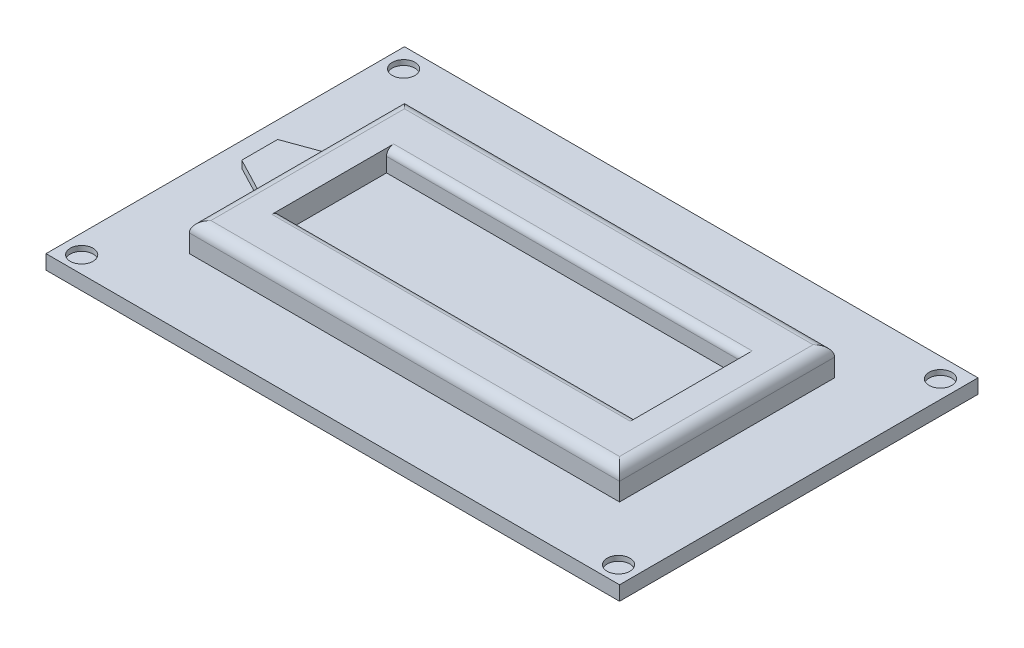
ISO-10303-21;
HEADER;
FILE_DESCRIPTION(('STEP AP214'),'2;1');
FILE_NAME('part.step','',(''),(''),'','','');
FILE_SCHEMA(('AUTOMOTIVE_DESIGN { 1 0 10303 214 1 1 1 1 }'));
ENDSEC;
DATA;
#1=APPLICATION_CONTEXT('core data for automotive mechanical design processes');
#2=APPLICATION_PROTOCOL_DEFINITION('international standard','automotive_design',2000,#1);
#3=PRODUCT_CONTEXT('',#1,'mechanical');
#4=PRODUCT('Part','Part','',(#3));
#5=PRODUCT_RELATED_PRODUCT_CATEGORY('part','',(#4));
#6=PRODUCT_DEFINITION_FORMATION('','',#4);
#7=PRODUCT_DEFINITION_CONTEXT('part definition',#1,'design');
#8=PRODUCT_DEFINITION('design','',#6,#7);
#9=PRODUCT_DEFINITION_SHAPE('','',#8);
#10=(LENGTH_UNIT() NAMED_UNIT(*) SI_UNIT(.MILLI.,.METRE.));
#11=(NAMED_UNIT(*) PLANE_ANGLE_UNIT() SI_UNIT($,.RADIAN.));
#12=(NAMED_UNIT(*) SI_UNIT($,.STERADIAN.) SOLID_ANGLE_UNIT());
#13=UNCERTAINTY_MEASURE_WITH_UNIT(LENGTH_MEASURE(1.E-05),#10,'distance_accuracy_value','');
#14=(GEOMETRIC_REPRESENTATION_CONTEXT(3) GLOBAL_UNCERTAINTY_ASSIGNED_CONTEXT((#13)) GLOBAL_UNIT_ASSIGNED_CONTEXT((#10,
#11,#12)) REPRESENTATION_CONTEXT('',''));
#15=CARTESIAN_POINT('',(0.,0.,0.));
#16=DIRECTION('',(0.,0.,1.));
#17=DIRECTION('',(1.,0.,0.));
#18=AXIS2_PLACEMENT_3D('',#15,#16,#17);
#19=CARTESIAN_POINT('',(-47.7639751552795,6.,-10.9627329192547));
#20=DIRECTION('',(1.,0.,0.));
#21=DIRECTION('',(0.,0.,-1.));
#22=AXIS2_PLACEMENT_3D('',#19,#20,#21);
#23=PLANE('',#22);
#24=DIRECTION('',(0.,-1.,0.));
#25=VECTOR('',#24,1.);
#26=CARTESIAN_POINT('',(-47.7639751552795,6.,19.0372670807453));
#27=LINE('',#26,#25);
#28=CARTESIAN_POINT('',(-47.7639751552795,4.5,19.0372670807453));
#29=VERTEX_POINT('',#28);
#30=CARTESIAN_POINT('',(-47.7639751552795,2.,19.0372670807453));
#31=VERTEX_POINT('',#30);
#32=EDGE_CURVE('E271',#29,#31,#27,.T.);
#33=ORIENTED_EDGE('',*,*,#32,.F.);
#34=DIRECTION('',(0.,0.,1.));
#35=VECTOR('',#34,1.);
#36=CARTESIAN_POINT('',(-47.7639751552795,4.5,-10.9627329192547));
#37=LINE('',#36,#35);
#38=CARTESIAN_POINT('',(-47.7639751552795,4.5,-10.9627329192547));
#39=VERTEX_POINT('',#38);
#40=EDGE_CURVE('E359',#29,#39,#37,.F.);
#41=ORIENTED_EDGE('',*,*,#40,.T.);
#42=DIRECTION('',(0.,-1.,0.));
#43=VECTOR('',#42,1.);
#44=CARTESIAN_POINT('',(-47.7639751552795,6.,-10.9627329192547));
#45=LINE('',#44,#43);
#46=CARTESIAN_POINT('',(-47.7639751552795,2.,-10.9627329192547));
#47=VERTEX_POINT('',#46);
#48=EDGE_CURVE('E262',#39,#47,#45,.T.);
#49=ORIENTED_EDGE('',*,*,#48,.T.);
#50=DIRECTION('',(0.,0.,1.));
#51=VECTOR('',#50,1.);
#52=CARTESIAN_POINT('',(-47.7639751552795,2.,-10.9627329192547));
#53=LINE('',#52,#51);
#54=EDGE_CURVE('E246',#47,#31,#53,.T.);
#55=ORIENTED_EDGE('',*,*,#54,.T.);
#56=EDGE_LOOP('',(#33,#41,#49,#55));
#57=FACE_BOUND('',#56,.T.);
#58=DIRECTION('',(0.,0.,-1.));
#59=VECTOR('',#58,1.);
#60=CARTESIAN_POINT('',(-47.7639751552795,4.,-0.962732919254658));
#61=LINE('',#60,#59);
#62=CARTESIAN_POINT('',(-47.7639751552795,4.,9.03726708074534));
#63=VERTEX_POINT('',#62);
#64=CARTESIAN_POINT('',(-47.7639751552795,4.,-0.962732919254658));
#65=VERTEX_POINT('',#64);
#66=EDGE_CURVE('E196',#63,#65,#61,.T.);
#67=ORIENTED_EDGE('',*,*,#66,.F.);
#68=DIRECTION('',(0.,-1.,0.));
#69=VECTOR('',#68,1.);
#70=CARTESIAN_POINT('',(-47.7639751552795,4.,9.03726708074534));
#71=LINE('',#70,#69);
#72=CARTESIAN_POINT('',(-47.7639751552795,3.,9.03726708074534));
#73=VERTEX_POINT('',#72);
#74=EDGE_CURVE('E213',#63,#73,#71,.T.);
#75=ORIENTED_EDGE('',*,*,#74,.T.);
#76=DIRECTION('',(0.,0.,-1.));
#77=VECTOR('',#76,1.);
#78=CARTESIAN_POINT('',(-47.7639751552795,3.,-0.962732919254658));
#79=LINE('',#78,#77);
#80=CARTESIAN_POINT('',(-47.7639751552795,3.,-0.962732919254658));
#81=VERTEX_POINT('',#80);
#82=EDGE_CURVE('E201',#73,#81,#79,.T.);
#83=ORIENTED_EDGE('',*,*,#82,.T.);
#84=DIRECTION('',(0.,-1.,0.));
#85=VECTOR('',#84,1.);
#86=CARTESIAN_POINT('',(-47.7639751552795,4.,-0.962732919254658));
#87=LINE('',#86,#85);
#88=EDGE_CURVE('E399',#65,#81,#87,.T.);
#89=ORIENTED_EDGE('',*,*,#88,.F.);
#90=EDGE_LOOP('',(#67,#75,#83,#89));
#91=FACE_BOUND('',#90,.T.);
#92=ADVANCED_FACE('F40',(#57,#91),#23,.F.);
#93=CARTESIAN_POINT('',(0.,2.,0.));
#94=DIRECTION('',(0.,1.,0.));
#95=DIRECTION('',(0.,0.,1.));
#96=AXIS2_PLACEMENT_3D('',#93,#94,#95);
#97=PLANE('',#96);
#98=CARTESIAN_POINT('',(-55.1397341812617,2.,-18.2194783114628));
#99=DIRECTION('',(0.,1.,0.));
#100=DIRECTION('',(0.,0.,1.));
#101=AXIS2_PLACEMENT_3D('',#98,#99,#100);
#102=CIRCLE('',#101,1.5875);
#103=CARTESIAN_POINT('',(-55.1397341812617,2.,-16.6319783114628));
#104=VERTEX_POINT('',#103);
#105=EDGE_CURVE('E762',#104,#104,#102,.T.);
#106=ORIENTED_EDGE('',*,*,#105,.F.);
#107=EDGE_LOOP('',(#106));
#108=FACE_BOUND('',#107,.T.);
#109=CARTESIAN_POINT('',(19.7415608117652,2.,-18.2194783114628));
#110=DIRECTION('',(0.,1.,0.));
#111=DIRECTION('',(0.,0.,1.));
#112=AXIS2_PLACEMENT_3D('',#109,#110,#111);
#113=CIRCLE('',#112,1.5875);
#114=CARTESIAN_POINT('',(19.7415608117652,2.,-16.6319783114628));
#115=VERTEX_POINT('',#114);
#116=EDGE_CURVE('E772',#115,#115,#113,.T.);
#117=ORIENTED_EDGE('',*,*,#116,.F.);
#118=EDGE_LOOP('',(#117));
#119=FACE_BOUND('',#118,.T.);
#120=CARTESIAN_POINT('',(-55.1397341812617,2.,26.6833432961408));
#121=DIRECTION('',(0.,1.,0.));
#122=DIRECTION('',(0.,0.,1.));
#123=AXIS2_PLACEMENT_3D('',#120,#121,#122);
#124=CIRCLE('',#123,1.5875);
#125=CARTESIAN_POINT('',(-55.1397341812617,2.,28.2708432961408));
#126=VERTEX_POINT('',#125);
#127=EDGE_CURVE('E780',#126,#126,#124,.T.);
#128=ORIENTED_EDGE('',*,*,#127,.F.);
#129=EDGE_LOOP('',(#128));
#130=FACE_BOUND('',#129,.T.);
#131=CARTESIAN_POINT('',(19.7415608117652,2.,26.6833432961408));
#132=DIRECTION('',(0.,1.,0.));
#133=DIRECTION('',(0.,0.,1.));
#134=AXIS2_PLACEMENT_3D('',#131,#132,#133);
#135=CIRCLE('',#134,1.5875);
#136=CARTESIAN_POINT('',(19.7415608117652,2.,28.2708432961408));
#137=VERTEX_POINT('',#136);
#138=EDGE_CURVE('E371',#137,#137,#135,.T.);
#139=ORIENTED_EDGE('',*,*,#138,.F.);
#140=EDGE_LOOP('',(#139));
#141=FACE_BOUND('',#140,.T.);
#142=DIRECTION('',(0.,0.,1.));
#143=VECTOR('',#142,1.);
#144=CARTESIAN_POINT('',(-57.7639751552795,2.,-20.9627329192547));
#145=LINE('',#144,#143);
#146=CARTESIAN_POINT('',(-57.7639751552795,2.,-20.9627329192547));
#147=VERTEX_POINT('',#146);
#148=CARTESIAN_POINT('',(-57.7639751552795,2.,29.0372670807453));
#149=VERTEX_POINT('',#148);
#150=EDGE_CURVE('E275',#147,#149,#145,.T.);
#151=ORIENTED_EDGE('',*,*,#150,.T.);
#152=DIRECTION('',(1.,0.,0.));
#153=VECTOR('',#152,1.);
#154=CARTESIAN_POINT('',(-57.7639751552795,2.,29.0372670807453));
#155=LINE('',#154,#153);
#156=CARTESIAN_POINT('',(22.2360248447205,2.,29.0372670807453));
#157=VERTEX_POINT('',#156);
#158=EDGE_CURVE('E279',#149,#157,#155,.T.);
#159=ORIENTED_EDGE('',*,*,#158,.T.);
#160=DIRECTION('',(0.,0.,-1.));
#161=VECTOR('',#160,1.);
#162=CARTESIAN_POINT('',(22.2360248447205,2.,-20.9627329192547));
#163=LINE('',#162,#161);
#164=CARTESIAN_POINT('',(22.2360248447205,2.,-20.9627329192547));
#165=VERTEX_POINT('',#164);
#166=EDGE_CURVE('E283',#157,#165,#163,.T.);
#167=ORIENTED_EDGE('',*,*,#166,.T.);
#168=DIRECTION('',(-1.,0.,0.));
#169=VECTOR('',#168,1.);
#170=CARTESIAN_POINT('',(-57.7639751552795,2.,-20.9627329192547));
#171=LINE('',#170,#169);
#172=EDGE_CURVE('E286',#165,#147,#171,.T.);
#173=ORIENTED_EDGE('',*,*,#172,.T.);
#174=EDGE_LOOP('',(#151,#159,#167,#173));
#175=FACE_BOUND('',#174,.T.);
#176=DIRECTION('',(1.,0.,0.));
#177=VECTOR('',#176,1.);
#178=CARTESIAN_POINT('',(-47.7639751552795,2.,19.0372670807453));
#179=LINE('',#178,#177);
#180=CARTESIAN_POINT('',(12.2360248447205,2.,19.0372670807453));
#181=VERTEX_POINT('',#180);
#182=EDGE_CURVE('E250',#31,#181,#179,.T.);
#183=ORIENTED_EDGE('',*,*,#182,.F.);
#184=ORIENTED_EDGE('',*,*,#54,.F.);
#185=DIRECTION('',(-1.,0.,0.));
#186=VECTOR('',#185,1.);
#187=CARTESIAN_POINT('',(-47.7639751552795,2.,-10.9627329192547));
#188=LINE('',#187,#186);
#189=CARTESIAN_POINT('',(12.2360248447205,2.,-10.9627329192547));
#190=VERTEX_POINT('',#189);
#191=EDGE_CURVE('E258',#190,#47,#188,.T.);
#192=ORIENTED_EDGE('',*,*,#191,.F.);
#193=DIRECTION('',(0.,0.,-1.));
#194=VECTOR('',#193,1.);
#195=CARTESIAN_POINT('',(12.2360248447205,2.,-10.9627329192547));
#196=LINE('',#195,#194);
#197=EDGE_CURVE('E254',#181,#190,#196,.T.);
#198=ORIENTED_EDGE('',*,*,#197,.F.);
#199=EDGE_LOOP('',(#183,#184,#192,#198));
#200=FACE_BOUND('',#199,.T.);
#201=ADVANCED_FACE('F424',(#108,#119,#130,#141,#175,#200),#97,.T.);
#202=CARTESIAN_POINT('',(-57.7639751552795,2.,-20.9627329192547));
#203=DIRECTION('',(1.,0.,0.));
#204=DIRECTION('',(0.,0.,-1.));
#205=AXIS2_PLACEMENT_3D('',#202,#203,#204);
#206=PLANE('',#205);
#207=DIRECTION('',(0.,0.,1.));
#208=VECTOR('',#207,1.);
#209=CARTESIAN_POINT('',(-57.7639751552795,0.,-20.9627329192547));
#210=LINE('',#209,#208);
#211=CARTESIAN_POINT('',(-57.7639751552795,0.,-20.9627329192547));
#212=VERTEX_POINT('',#211);
#213=CARTESIAN_POINT('',(-57.7639751552795,0.,29.0372670807453));
#214=VERTEX_POINT('',#213);
#215=EDGE_CURVE('E274',#212,#214,#210,.T.);
#216=ORIENTED_EDGE('',*,*,#215,.T.);
#217=DIRECTION('',(0.,-1.,0.));
#218=VECTOR('',#217,1.);
#219=CARTESIAN_POINT('',(-57.7639751552795,2.,29.0372670807453));
#220=LINE('',#219,#218);
#221=EDGE_CURVE('E312',#149,#214,#220,.T.);
#222=ORIENTED_EDGE('',*,*,#221,.F.);
#223=ORIENTED_EDGE('',*,*,#150,.F.);
#224=DIRECTION('',(0.,-1.,0.));
#225=VECTOR('',#224,1.);
#226=CARTESIAN_POINT('',(-57.7639751552795,2.,-20.9627329192547));
#227=LINE('',#226,#225);
#228=EDGE_CURVE('E289',#147,#212,#227,.T.);
#229=ORIENTED_EDGE('',*,*,#228,.T.);
#230=EDGE_LOOP('',(#216,#222,#223,#229));
#231=FACE_BOUND('',#230,.T.);
#232=ADVANCED_FACE('F432',(#231),#206,.F.);
#233=CARTESIAN_POINT('',(-57.7639751552795,2.,29.0372670807453));
#234=DIRECTION('',(0.,0.,-1.));
#235=DIRECTION('',(-1.,0.,0.));
#236=AXIS2_PLACEMENT_3D('',#233,#234,#235);
#237=PLANE('',#236);
#238=DIRECTION('',(1.,0.,0.));
#239=VECTOR('',#238,1.);
#240=CARTESIAN_POINT('',(-57.7639751552795,0.,29.0372670807453));
#241=LINE('',#240,#239);
#242=CARTESIAN_POINT('',(22.2360248447205,0.,29.0372670807453));
#243=VERTEX_POINT('',#242);
#244=EDGE_CURVE('E293',#214,#243,#241,.T.);
#245=ORIENTED_EDGE('',*,*,#244,.T.);
#246=DIRECTION('',(0.,-1.,0.));
#247=VECTOR('',#246,1.);
#248=CARTESIAN_POINT('',(22.2360248447205,2.,29.0372670807453));
#249=LINE('',#248,#247);
#250=EDGE_CURVE('E308',#157,#243,#249,.T.);
#251=ORIENTED_EDGE('',*,*,#250,.F.);
#252=ORIENTED_EDGE('',*,*,#158,.F.);
#253=ORIENTED_EDGE('',*,*,#221,.T.);
#254=EDGE_LOOP('',(#245,#251,#252,#253));
#255=FACE_BOUND('',#254,.T.);
#256=ADVANCED_FACE('F452',(#255),#237,.F.);
#257=CARTESIAN_POINT('',(22.2360248447205,2.,-20.9627329192547));
#258=DIRECTION('',(-1.,0.,0.));
#259=DIRECTION('',(0.,0.,1.));
#260=AXIS2_PLACEMENT_3D('',#257,#258,#259);
#261=PLANE('',#260);
#262=DIRECTION('',(0.,0.,-1.));
#263=VECTOR('',#262,1.);
#264=CARTESIAN_POINT('',(22.2360248447205,0.,-20.9627329192547));
#265=LINE('',#264,#263);
#266=CARTESIAN_POINT('',(22.2360248447205,0.,-20.9627329192547));
#267=VERTEX_POINT('',#266);
#268=EDGE_CURVE('E296',#243,#267,#265,.T.);
#269=ORIENTED_EDGE('',*,*,#268,.T.);
#270=DIRECTION('',(0.,-1.,0.));
#271=VECTOR('',#270,1.);
#272=CARTESIAN_POINT('',(22.2360248447205,2.,-20.9627329192547));
#273=LINE('',#272,#271);
#274=EDGE_CURVE('E304',#165,#267,#273,.T.);
#275=ORIENTED_EDGE('',*,*,#274,.F.);
#276=ORIENTED_EDGE('',*,*,#166,.F.);
#277=ORIENTED_EDGE('',*,*,#250,.T.);
#278=EDGE_LOOP('',(#269,#275,#276,#277));
#279=FACE_BOUND('',#278,.T.);
#280=ADVANCED_FACE('F448',(#279),#261,.F.);
#281=CARTESIAN_POINT('',(-57.7639751552795,2.,-20.9627329192547));
#282=DIRECTION('',(0.,0.,1.));
#283=DIRECTION('',(1.,0.,0.));
#284=AXIS2_PLACEMENT_3D('',#281,#282,#283);
#285=PLANE('',#284);
#286=DIRECTION('',(-1.,0.,0.));
#287=VECTOR('',#286,1.);
#288=CARTESIAN_POINT('',(-57.7639751552795,0.,-20.9627329192547));
#289=LINE('',#288,#287);
#290=EDGE_CURVE('E280',#267,#212,#289,.T.);
#291=ORIENTED_EDGE('',*,*,#290,.T.);
#292=ORIENTED_EDGE('',*,*,#228,.F.);
#293=ORIENTED_EDGE('',*,*,#172,.F.);
#294=ORIENTED_EDGE('',*,*,#274,.T.);
#295=EDGE_LOOP('',(#291,#292,#293,#294));
#296=FACE_BOUND('',#295,.T.);
#297=ADVANCED_FACE('F444',(#296),#285,.F.);
#298=CARTESIAN_POINT('',(0.,0.,0.));
#299=DIRECTION('',(0.,1.,0.));
#300=DIRECTION('',(0.,0.,1.));
#301=AXIS2_PLACEMENT_3D('',#298,#299,#300);
#302=PLANE('',#301);
#303=ORIENTED_EDGE('',*,*,#215,.F.);
#304=ORIENTED_EDGE('',*,*,#290,.F.);
#305=ORIENTED_EDGE('',*,*,#268,.F.);
#306=ORIENTED_EDGE('',*,*,#244,.F.);
#307=EDGE_LOOP('',(#303,#304,#305,#306));
#308=FACE_BOUND('',#307,.T.);
#309=ADVANCED_FACE('F440',(#308),#302,.F.);
#310=CARTESIAN_POINT('',(0.,6.,0.));
#311=DIRECTION('',(0.,1.,0.));
#312=DIRECTION('',(0.,0.,1.));
#313=AXIS2_PLACEMENT_3D('',#310,#311,#312);
#314=PLANE('',#313);
#315=DIRECTION('',(-1.,0.,0.));
#316=VECTOR('',#315,1.);
#317=CARTESIAN_POINT('',(-47.7639751552795,6.,-9.46273291925466));
#318=LINE('',#317,#316);
#319=CARTESIAN_POINT('',(10.7360248447205,6.,-9.46273291925466));
#320=VERTEX_POINT('',#319);
#321=CARTESIAN_POINT('',(-46.2639751552795,6.,-9.46273291925466));
#322=VERTEX_POINT('',#321);
#323=EDGE_CURVE('E352',#320,#322,#318,.T.);
#324=ORIENTED_EDGE('',*,*,#323,.T.);
#325=DIRECTION('',(0.,0.,1.));
#326=VECTOR('',#325,1.);
#327=CARTESIAN_POINT('',(-46.2639751552795,6.,19.0372670807453));
#328=LINE('',#327,#326);
#329=CARTESIAN_POINT('',(-46.2639751552795,6.,17.5372670807453));
#330=VERTEX_POINT('',#329);
#331=EDGE_CURVE('E355',#322,#330,#328,.T.);
#332=ORIENTED_EDGE('',*,*,#331,.T.);
#333=DIRECTION('',(1.,0.,0.));
#334=VECTOR('',#333,1.);
#335=CARTESIAN_POINT('',(12.2360248447205,6.,17.5372670807453));
#336=LINE('',#335,#334);
#337=CARTESIAN_POINT('',(10.7360248447205,6.,17.5372670807453));
#338=VERTEX_POINT('',#337);
#339=EDGE_CURVE('E346',#330,#338,#336,.T.);
#340=ORIENTED_EDGE('',*,*,#339,.T.);
#341=DIRECTION('',(0.,0.,-1.));
#342=VECTOR('',#341,1.);
#343=CARTESIAN_POINT('',(10.7360248447205,6.,-10.9627329192547));
#344=LINE('',#343,#342);
#345=EDGE_CURVE('E349',#338,#320,#344,.T.);
#346=ORIENTED_EDGE('',*,*,#345,.T.);
#347=EDGE_LOOP('',(#324,#332,#340,#346));
#348=FACE_BOUND('',#347,.T.);
#349=DIRECTION('',(0.,0.,-1.));
#350=VECTOR('',#349,1.);
#351=CARTESIAN_POINT('',(7.23602484472052,6.,-3.46273291925466));
#352=LINE('',#351,#350);
#353=CARTESIAN_POINT('',(7.23602484472052,6.,12.5372670807453));
#354=VERTEX_POINT('',#353);
#355=CARTESIAN_POINT('',(7.23602484472052,6.,-4.46273291925466));
#356=VERTEX_POINT('',#355);
#357=EDGE_CURVE('E231',#354,#356,#352,.T.);
#358=ORIENTED_EDGE('',*,*,#357,.F.);
#359=DIRECTION('',(1.,0.,0.));
#360=VECTOR('',#359,1.);
#361=CARTESIAN_POINT('',(0.,6.,12.5372670807453));
#362=LINE('',#361,#360);
#363=CARTESIAN_POINT('',(-42.7639751552795,6.,12.5372670807453));
#364=VERTEX_POINT('',#363);
#365=EDGE_CURVE('E324',#354,#364,#362,.F.);
#366=ORIENTED_EDGE('',*,*,#365,.T.);
#367=DIRECTION('',(0.,0.,1.));
#368=VECTOR('',#367,1.);
#369=CARTESIAN_POINT('',(-42.7639751552795,6.,-3.46273291925466));
#370=LINE('',#369,#368);
#371=CARTESIAN_POINT('',(-42.7639751552795,6.,-4.46273291925466));
#372=VERTEX_POINT('',#371);
#373=EDGE_CURVE('E228',#372,#364,#370,.T.);
#374=ORIENTED_EDGE('',*,*,#373,.F.);
#375=DIRECTION('',(-1.,0.,0.));
#376=VECTOR('',#375,1.);
#377=CARTESIAN_POINT('',(0.,6.,-4.46273291925466));
#378=LINE('',#377,#376);
#379=EDGE_CURVE('E320',#372,#356,#378,.F.);
#380=ORIENTED_EDGE('',*,*,#379,.T.);
#381=EDGE_LOOP('',(#358,#366,#374,#380));
#382=FACE_BOUND('',#381,.T.);
#383=ADVANCED_FACE('F443',(#348,#382),#314,.T.);
#384=CARTESIAN_POINT('',(-47.7639751552795,6.,19.0372670807453));
#385=DIRECTION('',(0.,0.,-1.));
#386=DIRECTION('',(-1.,0.,0.));
#387=AXIS2_PLACEMENT_3D('',#384,#385,#386);
#388=PLANE('',#387);
#389=DIRECTION('',(0.,-1.,0.));
#390=VECTOR('',#389,1.);
#391=CARTESIAN_POINT('',(12.2360248447205,6.,19.0372670807453));
#392=LINE('',#391,#390);
#393=CARTESIAN_POINT('',(12.2360248447205,4.5,19.0372670807453));
#394=VERTEX_POINT('',#393);
#395=EDGE_CURVE('E268',#394,#181,#392,.T.);
#396=ORIENTED_EDGE('',*,*,#395,.F.);
#397=DIRECTION('',(1.,0.,0.));
#398=VECTOR('',#397,1.);
#399=CARTESIAN_POINT('',(-47.7639751552795,4.5,19.0372670807453));
#400=LINE('',#399,#398);
#401=EDGE_CURVE('E11',#394,#29,#400,.F.);
#402=ORIENTED_EDGE('',*,*,#401,.T.);
#403=ORIENTED_EDGE('',*,*,#32,.T.);
#404=ORIENTED_EDGE('',*,*,#182,.T.);
#405=EDGE_LOOP('',(#396,#402,#403,#404));
#406=FACE_BOUND('',#405,.T.);
#407=ADVANCED_FACE('F437',(#406),#388,.F.);
#408=CARTESIAN_POINT('',(12.2360248447205,6.,-10.9627329192547));
#409=DIRECTION('',(-1.,0.,0.));
#410=DIRECTION('',(0.,0.,1.));
#411=AXIS2_PLACEMENT_3D('',#408,#409,#410);
#412=PLANE('',#411);
#413=DIRECTION('',(0.,-1.,0.));
#414=VECTOR('',#413,1.);
#415=CARTESIAN_POINT('',(12.2360248447205,6.,-10.9627329192547));
#416=LINE('',#415,#414);
#417=CARTESIAN_POINT('',(12.2360248447205,4.5,-10.9627329192547));
#418=VERTEX_POINT('',#417);
#419=EDGE_CURVE('E265',#418,#190,#416,.T.);
#420=ORIENTED_EDGE('',*,*,#419,.F.);
#421=DIRECTION('',(0.,0.,-1.));
#422=VECTOR('',#421,1.);
#423=CARTESIAN_POINT('',(12.2360248447205,4.5,19.0372670807453));
#424=LINE('',#423,#422);
#425=EDGE_CURVE('E50',#418,#394,#424,.F.);
#426=ORIENTED_EDGE('',*,*,#425,.T.);
#427=ORIENTED_EDGE('',*,*,#395,.T.);
#428=ORIENTED_EDGE('',*,*,#197,.T.);
#429=EDGE_LOOP('',(#420,#426,#427,#428));
#430=FACE_BOUND('',#429,.T.);
#431=ADVANCED_FACE('F528',(#430),#412,.F.);
#432=CARTESIAN_POINT('',(-47.7639751552795,6.,-10.9627329192547));
#433=DIRECTION('',(0.,0.,1.));
#434=DIRECTION('',(1.,0.,0.));
#435=AXIS2_PLACEMENT_3D('',#432,#433,#434);
#436=PLANE('',#435);
#437=ORIENTED_EDGE('',*,*,#48,.F.);
#438=DIRECTION('',(-1.,0.,0.));
#439=VECTOR('',#438,1.);
#440=CARTESIAN_POINT('',(12.2360248447205,4.5,-10.9627329192547));
#441=LINE('',#440,#439);
#442=EDGE_CURVE('E65',#39,#418,#441,.F.);
#443=ORIENTED_EDGE('',*,*,#442,.T.);
#444=ORIENTED_EDGE('',*,*,#419,.T.);
#445=ORIENTED_EDGE('',*,*,#191,.T.);
#446=EDGE_LOOP('',(#437,#443,#444,#445));
#447=FACE_BOUND('',#446,.T.);
#448=ADVANCED_FACE('F526',(#447),#436,.F.);
#449=CARTESIAN_POINT('',(-42.7639751552795,6.,-3.46273291925466));
#450=DIRECTION('',(1.,0.,0.));
#451=DIRECTION('',(0.,0.,-1.));
#452=AXIS2_PLACEMENT_3D('',#449,#450,#451);
#453=PLANE('',#452);
#454=DIRECTION('',(0.,0.,1.));
#455=VECTOR('',#454,1.);
#456=CARTESIAN_POINT('',(-42.7639751552795,3.,-3.46273291925466));
#457=LINE('',#456,#455);
#458=CARTESIAN_POINT('',(-42.7639751552795,3.,-3.46273291925466));
#459=VERTEX_POINT('',#458);
#460=CARTESIAN_POINT('',(-42.7639751552795,3.,11.5372670807453));
#461=VERTEX_POINT('',#460);
#462=EDGE_CURVE('E206',#459,#461,#457,.T.);
#463=ORIENTED_EDGE('',*,*,#462,.F.);
#464=DIRECTION('',(0.,-1.,0.));
#465=VECTOR('',#464,1.);
#466=CARTESIAN_POINT('',(-42.7639751552795,6.,-3.46273291925466));
#467=LINE('',#466,#465);
#468=CARTESIAN_POINT('',(-42.7639751552795,5.,-3.46273291925466));
#469=VERTEX_POINT('',#468);
#470=EDGE_CURVE('E234',#469,#459,#467,.T.);
#471=ORIENTED_EDGE('',*,*,#470,.F.);
#472=CARTESIAN_POINT('',(-42.7639751552795,5.,-4.46273291925466));
#473=DIRECTION('',(1.,0.,0.));
#474=DIRECTION('',(0.,0.,-1.));
#475=AXIS2_PLACEMENT_3D('',#472,#473,#474);
#476=CIRCLE('',#475,1.);
#477=EDGE_CURVE('E339',#469,#372,#476,.F.);
#478=ORIENTED_EDGE('',*,*,#477,.T.);
#479=ORIENTED_EDGE('',*,*,#373,.T.);
#480=CARTESIAN_POINT('',(-42.7639751552795,5.,12.5372670807453));
#481=DIRECTION('',(1.,0.,0.));
#482=DIRECTION('',(0.,0.,-1.));
#483=AXIS2_PLACEMENT_3D('',#480,#481,#482);
#484=CIRCLE('',#483,1.);
#485=CARTESIAN_POINT('',(-42.7639751552795,5.,11.5372670807453));
#486=VERTEX_POINT('',#485);
#487=EDGE_CURVE('E336',#364,#486,#484,.F.);
#488=ORIENTED_EDGE('',*,*,#487,.T.);
#489=DIRECTION('',(0.,-1.,0.));
#490=VECTOR('',#489,1.);
#491=CARTESIAN_POINT('',(-42.7639751552795,6.,11.5372670807453));
#492=LINE('',#491,#490);
#493=EDGE_CURVE('E243',#486,#461,#492,.T.);
#494=ORIENTED_EDGE('',*,*,#493,.T.);
#495=EDGE_LOOP('',(#463,#471,#478,#479,#488,#494));
#496=FACE_BOUND('',#495,.T.);
#497=ADVANCED_FACE('F501',(#496),#453,.T.);
#498=CARTESIAN_POINT('',(-42.7639751552795,6.,11.5372670807453));
#499=DIRECTION('',(0.,0.,-1.));
#500=DIRECTION('',(-1.,0.,0.));
#501=AXIS2_PLACEMENT_3D('',#498,#499,#500);
#502=PLANE('',#501);
#503=ORIENTED_EDGE('',*,*,#493,.F.);
#504=DIRECTION('',(1.,0.,0.));
#505=VECTOR('',#504,1.);
#506=CARTESIAN_POINT('',(-42.7639751552795,5.,11.5372670807453));
#507=LINE('',#506,#505);
#508=CARTESIAN_POINT('',(7.23602484472052,5.,11.5372670807453));
#509=VERTEX_POINT('',#508);
#510=EDGE_CURVE('E316',#486,#509,#507,.T.);
#511=ORIENTED_EDGE('',*,*,#510,.T.);
#512=DIRECTION('',(0.,-1.,0.));
#513=VECTOR('',#512,1.);
#514=CARTESIAN_POINT('',(7.23602484472052,6.,11.5372670807453));
#515=LINE('',#514,#513);
#516=CARTESIAN_POINT('',(7.23602484472052,3.,11.5372670807453));
#517=VERTEX_POINT('',#516);
#518=EDGE_CURVE('E240',#509,#517,#515,.T.);
#519=ORIENTED_EDGE('',*,*,#518,.T.);
#520=DIRECTION('',(1.,0.,0.));
#521=VECTOR('',#520,1.);
#522=CARTESIAN_POINT('',(-42.7639751552795,3.,11.5372670807453));
#523=LINE('',#522,#521);
#524=EDGE_CURVE('E211',#461,#517,#523,.T.);
#525=ORIENTED_EDGE('',*,*,#524,.F.);
#526=EDGE_LOOP('',(#503,#511,#519,#525));
#527=FACE_BOUND('',#526,.T.);
#528=ADVANCED_FACE('F504',(#527),#502,.T.);
#529=CARTESIAN_POINT('',(7.23602484472052,6.,-3.46273291925466));
#530=DIRECTION('',(-1.,0.,0.));
#531=DIRECTION('',(0.,0.,1.));
#532=AXIS2_PLACEMENT_3D('',#529,#530,#531);
#533=PLANE('',#532);
#534=DIRECTION('',(0.,0.,-1.));
#535=VECTOR('',#534,1.);
#536=CARTESIAN_POINT('',(7.23602484472052,3.,-3.46273291925466));
#537=LINE('',#536,#535);
#538=CARTESIAN_POINT('',(7.23602484472052,3.,-3.46273291925466));
#539=VERTEX_POINT('',#538);
#540=EDGE_CURVE('E220',#517,#539,#537,.T.);
#541=ORIENTED_EDGE('',*,*,#540,.F.);
#542=ORIENTED_EDGE('',*,*,#518,.F.);
#543=CARTESIAN_POINT('',(7.23602484472052,5.,12.5372670807453));
#544=DIRECTION('',(-1.,0.,0.));
#545=DIRECTION('',(0.,0.,1.));
#546=AXIS2_PLACEMENT_3D('',#543,#544,#545);
#547=CIRCLE('',#546,1.);
#548=EDGE_CURVE('E332',#509,#354,#547,.F.);
#549=ORIENTED_EDGE('',*,*,#548,.T.);
#550=ORIENTED_EDGE('',*,*,#357,.T.);
#551=CARTESIAN_POINT('',(7.23602484472052,5.,-4.46273291925466));
#552=DIRECTION('',(-1.,0.,0.));
#553=DIRECTION('',(0.,0.,1.));
#554=AXIS2_PLACEMENT_3D('',#551,#552,#553);
#555=CIRCLE('',#554,1.);
#556=CARTESIAN_POINT('',(7.23602484472052,5.,-3.46273291925466));
#557=VERTEX_POINT('',#556);
#558=EDGE_CURVE('E343',#356,#557,#555,.F.);
#559=ORIENTED_EDGE('',*,*,#558,.T.);
#560=DIRECTION('',(0.,-1.,0.));
#561=VECTOR('',#560,1.);
#562=CARTESIAN_POINT('',(7.23602484472052,6.,-3.46273291925466));
#563=LINE('',#562,#561);
#564=EDGE_CURVE('E237',#557,#539,#563,.T.);
#565=ORIENTED_EDGE('',*,*,#564,.T.);
#566=EDGE_LOOP('',(#541,#542,#549,#550,#559,#565));
#567=FACE_BOUND('',#566,.T.);
#568=ADVANCED_FACE('F496',(#567),#533,.T.);
#569=CARTESIAN_POINT('',(-42.7639751552795,6.,-3.46273291925466));
#570=DIRECTION('',(0.,0.,1.));
#571=DIRECTION('',(1.,0.,0.));
#572=AXIS2_PLACEMENT_3D('',#569,#570,#571);
#573=PLANE('',#572);
#574=ORIENTED_EDGE('',*,*,#564,.F.);
#575=DIRECTION('',(-1.,0.,0.));
#576=VECTOR('',#575,1.);
#577=CARTESIAN_POINT('',(-42.7639751552795,5.,-3.46273291925466));
#578=LINE('',#577,#576);
#579=EDGE_CURVE('E328',#557,#469,#578,.T.);
#580=ORIENTED_EDGE('',*,*,#579,.T.);
#581=ORIENTED_EDGE('',*,*,#470,.T.);
#582=DIRECTION('',(-1.,0.,0.));
#583=VECTOR('',#582,1.);
#584=CARTESIAN_POINT('',(-42.7639751552795,3.,-3.46273291925466));
#585=LINE('',#584,#583);
#586=EDGE_CURVE('E224',#539,#459,#585,.T.);
#587=ORIENTED_EDGE('',*,*,#586,.F.);
#588=EDGE_LOOP('',(#574,#580,#581,#587));
#589=FACE_BOUND('',#588,.T.);
#590=ADVANCED_FACE('F511',(#589),#573,.T.);
#591=CARTESIAN_POINT('',(0.,3.,0.));
#592=DIRECTION('',(0.,1.,0.));
#593=DIRECTION('',(0.,0.,1.));
#594=AXIS2_PLACEMENT_3D('',#591,#592,#593);
#595=PLANE('',#594);
#596=ORIENTED_EDGE('',*,*,#462,.T.);
#597=ORIENTED_EDGE('',*,*,#524,.T.);
#598=ORIENTED_EDGE('',*,*,#540,.T.);
#599=ORIENTED_EDGE('',*,*,#586,.T.);
#600=EDGE_LOOP('',(#596,#597,#598,#599));
#601=FACE_BOUND('',#600,.T.);
#602=ADVANCED_FACE('F506',(#601),#595,.T.);
#603=CARTESIAN_POINT('',(-53.4021308799949,4.,1.08938794069938));
#604=DIRECTION('',(0.342020143325673,0.,0.939692620785907));
#605=DIRECTION('',(0.939692620785907,0.,-0.342020143325673));
#606=AXIS2_PLACEMENT_3D('',#603,#604,#605);
#607=PLANE('',#606);
#608=DIRECTION('',(-0.939692620785907,0.,0.342020143325673));
#609=VECTOR('',#608,1.);
#610=CARTESIAN_POINT('',(-53.4021308799949,3.,1.08938794069938));
#611=LINE('',#610,#609);
#612=CARTESIAN_POINT('',(-53.4021308799949,3.,1.08938794069938));
#613=VERTEX_POINT('',#612);
#614=EDGE_CURVE('E204',#81,#613,#611,.T.);
#615=ORIENTED_EDGE('',*,*,#614,.T.);
#616=DIRECTION('',(0.,-1.,0.));
#617=VECTOR('',#616,1.);
#618=CARTESIAN_POINT('',(-53.4021308799949,4.,1.08938794069938));
#619=LINE('',#618,#617);
#620=CARTESIAN_POINT('',(-53.4021308799949,4.,1.08938794069938));
#621=VERTEX_POINT('',#620);
#622=EDGE_CURVE('E183',#621,#613,#619,.T.);
#623=ORIENTED_EDGE('',*,*,#622,.F.);
#624=DIRECTION('',(-0.939692620785907,0.,0.342020143325673));
#625=VECTOR('',#624,1.);
#626=CARTESIAN_POINT('',(-53.4021308799949,4.,1.08938794069938));
#627=LINE('',#626,#625);
#628=EDGE_CURVE('E191',#65,#621,#627,.T.);
#629=ORIENTED_EDGE('',*,*,#628,.F.);
#630=ORIENTED_EDGE('',*,*,#88,.T.);
#631=EDGE_LOOP('',(#615,#623,#629,#630));
#632=FACE_BOUND('',#631,.T.);
#633=ADVANCED_FACE('F203',(#632),#607,.F.);
#634=CARTESIAN_POINT('',(-53.4021308799949,4.,6.08938794069938));
#635=DIRECTION('',(1.,0.,0.));
#636=DIRECTION('',(0.,0.,-1.));
#637=AXIS2_PLACEMENT_3D('',#634,#635,#636);
#638=PLANE('',#637);
#639=DIRECTION('',(0.,0.,1.));
#640=VECTOR('',#639,1.);
#641=CARTESIAN_POINT('',(-53.4021308799949,3.,6.08938794069938));
#642=LINE('',#641,#640);
#643=CARTESIAN_POINT('',(-53.4021308799949,3.,6.08938794069938));
#644=VERTEX_POINT('',#643);
#645=EDGE_CURVE('E386',#613,#644,#642,.T.);
#646=ORIENTED_EDGE('',*,*,#645,.T.);
#647=DIRECTION('',(0.,-1.,0.));
#648=VECTOR('',#647,1.);
#649=CARTESIAN_POINT('',(-53.4021308799949,4.,6.08938794069938));
#650=LINE('',#649,#648);
#651=CARTESIAN_POINT('',(-53.4021308799949,4.,6.08938794069938));
#652=VERTEX_POINT('',#651);
#653=EDGE_CURVE('E186',#652,#644,#650,.T.);
#654=ORIENTED_EDGE('',*,*,#653,.F.);
#655=DIRECTION('',(0.,0.,1.));
#656=VECTOR('',#655,1.);
#657=CARTESIAN_POINT('',(-53.4021308799949,4.,6.08938794069938));
#658=LINE('',#657,#656);
#659=EDGE_CURVE('E179',#621,#652,#658,.T.);
#660=ORIENTED_EDGE('',*,*,#659,.F.);
#661=ORIENTED_EDGE('',*,*,#622,.T.);
#662=EDGE_LOOP('',(#646,#654,#660,#661));
#663=FACE_BOUND('',#662,.T.);
#664=ADVANCED_FACE('F181',(#663),#638,.F.);
#665=CARTESIAN_POINT('',(-47.7639751552795,4.,9.03726708074534));
#666=DIRECTION('',(0.463335851014159,0.,-0.886182762845783));
#667=DIRECTION('',(-0.886182762845783,0.,-0.463335851014159));
#668=AXIS2_PLACEMENT_3D('',#665,#666,#667);
#669=PLANE('',#668);
#670=DIRECTION('',(0.886182762845783,0.,0.463335851014159));
#671=VECTOR('',#670,1.);
#672=CARTESIAN_POINT('',(-47.7639751552795,3.,9.03726708074534));
#673=LINE('',#672,#671);
#674=EDGE_CURVE('E389',#644,#73,#673,.T.);
#675=ORIENTED_EDGE('',*,*,#674,.T.);
#676=ORIENTED_EDGE('',*,*,#74,.F.);
#677=DIRECTION('',(0.886182762845783,0.,0.463335851014159));
#678=VECTOR('',#677,1.);
#679=CARTESIAN_POINT('',(-47.7639751552795,4.,9.03726708074534));
#680=LINE('',#679,#678);
#681=EDGE_CURVE('E190',#652,#63,#680,.T.);
#682=ORIENTED_EDGE('',*,*,#681,.F.);
#683=ORIENTED_EDGE('',*,*,#653,.T.);
#684=EDGE_LOOP('',(#675,#676,#682,#683));
#685=FACE_BOUND('',#684,.T.);
#686=ADVANCED_FACE('F407',(#685),#669,.F.);
#687=CARTESIAN_POINT('',(0.,4.,0.));
#688=DIRECTION('',(0.,-1.,0.));
#689=DIRECTION('',(0.,0.,-1.));
#690=AXIS2_PLACEMENT_3D('',#687,#688,#689);
#691=PLANE('',#690);
#692=ORIENTED_EDGE('',*,*,#628,.T.);
#693=ORIENTED_EDGE('',*,*,#659,.T.);
#694=ORIENTED_EDGE('',*,*,#681,.T.);
#695=ORIENTED_EDGE('',*,*,#66,.T.);
#696=EDGE_LOOP('',(#692,#693,#694,#695));
#697=FACE_BOUND('',#696,.T.);
#698=ADVANCED_FACE('F194',(#697),#691,.F.);
#699=CARTESIAN_POINT('',(0.,3.,0.));
#700=DIRECTION('',(0.,-1.,0.));
#701=DIRECTION('',(0.,0.,-1.));
#702=AXIS2_PLACEMENT_3D('',#699,#700,#701);
#703=PLANE('',#702);
#704=ORIENTED_EDGE('',*,*,#614,.F.);
#705=ORIENTED_EDGE('',*,*,#82,.F.);
#706=ORIENTED_EDGE('',*,*,#674,.F.);
#707=ORIENTED_EDGE('',*,*,#645,.F.);
#708=EDGE_LOOP('',(#704,#705,#706,#707));
#709=FACE_BOUND('',#708,.T.);
#710=ADVANCED_FACE('F410',(#709),#703,.T.);
#711=CARTESIAN_POINT('',(-42.7639751552795,5.,12.5372670807453));
#712=DIRECTION('',(1.,0.,0.));
#713=DIRECTION('',(0.,0.,-1.));
#714=AXIS2_PLACEMENT_3D('',#711,#712,#713);
#715=CYLINDRICAL_SURFACE('',#714,1.);
#716=ORIENTED_EDGE('',*,*,#487,.F.);
#717=ORIENTED_EDGE('',*,*,#365,.F.);
#718=ORIENTED_EDGE('',*,*,#548,.F.);
#719=ORIENTED_EDGE('',*,*,#510,.F.);
#720=EDGE_LOOP('',(#716,#717,#718,#719));
#721=FACE_BOUND('',#720,.T.);
#722=ADVANCED_FACE('F412',(#721),#715,.T.);
#723=CARTESIAN_POINT('',(-42.7639751552795,5.,-4.46273291925466));
#724=DIRECTION('',(-1.,0.,0.));
#725=DIRECTION('',(0.,0.,1.));
#726=AXIS2_PLACEMENT_3D('',#723,#724,#725);
#727=CYLINDRICAL_SURFACE('',#726,1.);
#728=ORIENTED_EDGE('',*,*,#558,.F.);
#729=ORIENTED_EDGE('',*,*,#379,.F.);
#730=ORIENTED_EDGE('',*,*,#477,.F.);
#731=ORIENTED_EDGE('',*,*,#579,.F.);
#732=EDGE_LOOP('',(#728,#729,#730,#731));
#733=FACE_BOUND('',#732,.T.);
#734=ADVANCED_FACE('F418',(#733),#727,.T.);
#735=CARTESIAN_POINT('',(10.7360248447205,4.5,0.));
#736=DIRECTION('',(0.,0.,1.));
#737=DIRECTION('',(1.,0.,0.));
#738=AXIS2_PLACEMENT_3D('',#735,#736,#737);
#739=CYLINDRICAL_SURFACE('',#738,1.5);
#740=CARTESIAN_POINT('',(10.7360248447205,4.5,17.5372670807453));
#741=DIRECTION('',(-0.707106781186547,0.,0.707106781186548));
#742=DIRECTION('',(-0.707106781186548,0.,-0.707106781186547));
#743=AXIS2_PLACEMENT_3D('',#740,#741,#742);
#744=ELLIPSE('',#743,2.12132034355964,1.5);
#745=EDGE_CURVE('E373',#394,#338,#744,.T.);
#746=ORIENTED_EDGE('',*,*,#745,.F.);
#747=ORIENTED_EDGE('',*,*,#425,.F.);
#748=CARTESIAN_POINT('',(10.7360248447205,4.5,-9.46273291925466));
#749=DIRECTION('',(0.707106781186548,0.,0.707106781186547));
#750=DIRECTION('',(-0.707106781186547,0.,0.707106781186548));
#751=AXIS2_PLACEMENT_3D('',#748,#749,#750);
#752=ELLIPSE('',#751,2.12132034355964,1.5);
#753=EDGE_CURVE('E44',#320,#418,#752,.F.);
#754=ORIENTED_EDGE('',*,*,#753,.F.);
#755=ORIENTED_EDGE('',*,*,#345,.F.);
#756=EDGE_LOOP('',(#746,#747,#754,#755));
#757=FACE_BOUND('',#756,.T.);
#758=ADVANCED_FACE('F42',(#757),#739,.T.);
#759=CARTESIAN_POINT('',(0.,4.5,-9.46273291925466));
#760=DIRECTION('',(1.,0.,0.));
#761=DIRECTION('',(0.,0.,-1.));
#762=AXIS2_PLACEMENT_3D('',#759,#760,#761);
#763=CYLINDRICAL_SURFACE('',#762,1.5);
#764=ORIENTED_EDGE('',*,*,#753,.T.);
#765=ORIENTED_EDGE('',*,*,#442,.F.);
#766=CARTESIAN_POINT('',(-46.2639751552795,4.5,-9.46273291925466));
#767=DIRECTION('',(0.707106781186547,0.,-0.707106781186548));
#768=DIRECTION('',(0.707106781186548,0.,0.707106781186547));
#769=AXIS2_PLACEMENT_3D('',#766,#767,#768);
#770=ELLIPSE('',#769,2.12132034355964,1.5);
#771=EDGE_CURVE('E370',#322,#39,#770,.F.);
#772=ORIENTED_EDGE('',*,*,#771,.F.);
#773=ORIENTED_EDGE('',*,*,#323,.F.);
#774=EDGE_LOOP('',(#764,#765,#772,#773));
#775=FACE_BOUND('',#774,.T.);
#776=ADVANCED_FACE('F470',(#775),#763,.T.);
#777=CARTESIAN_POINT('',(0.,4.5,17.5372670807453));
#778=DIRECTION('',(-1.,0.,0.));
#779=DIRECTION('',(0.,0.,1.));
#780=AXIS2_PLACEMENT_3D('',#777,#778,#779);
#781=CYLINDRICAL_SURFACE('',#780,1.5);
#782=ORIENTED_EDGE('',*,*,#745,.T.);
#783=ORIENTED_EDGE('',*,*,#339,.F.);
#784=CARTESIAN_POINT('',(-46.2639751552795,4.5,17.5372670807453));
#785=DIRECTION('',(-0.707106781186548,0.,-0.707106781186547));
#786=DIRECTION('',(-0.707106781186547,0.,0.707106781186548));
#787=AXIS2_PLACEMENT_3D('',#784,#785,#786);
#788=ELLIPSE('',#787,2.12132034355964,1.5);
#789=EDGE_CURVE('E367',#29,#330,#788,.T.);
#790=ORIENTED_EDGE('',*,*,#789,.F.);
#791=ORIENTED_EDGE('',*,*,#401,.F.);
#792=EDGE_LOOP('',(#782,#783,#790,#791));
#793=FACE_BOUND('',#792,.T.);
#794=ADVANCED_FACE('F467',(#793),#781,.T.);
#795=CARTESIAN_POINT('',(-46.2639751552795,4.5,0.));
#796=DIRECTION('',(0.,0.,-1.));
#797=DIRECTION('',(-1.,0.,0.));
#798=AXIS2_PLACEMENT_3D('',#795,#796,#797);
#799=CYLINDRICAL_SURFACE('',#798,1.5);
#800=ORIENTED_EDGE('',*,*,#771,.T.);
#801=ORIENTED_EDGE('',*,*,#40,.F.);
#802=ORIENTED_EDGE('',*,*,#789,.T.);
#803=ORIENTED_EDGE('',*,*,#331,.F.);
#804=EDGE_LOOP('',(#800,#801,#802,#803));
#805=FACE_BOUND('',#804,.T.);
#806=ADVANCED_FACE('F463',(#805),#799,.T.);
#807=CARTESIAN_POINT('',(19.7415608117652,2.,26.6833432961408));
#808=DIRECTION('',(0.,1.,0.));
#809=DIRECTION('',(0.,0.,1.));
#810=AXIS2_PLACEMENT_3D('',#807,#808,#809);
#811=CYLINDRICAL_SURFACE('',#810,1.5875);
#812=CARTESIAN_POINT('',(19.7415608117652,1.2888,26.6833432961408));
#813=DIRECTION('',(0.,1.,0.));
#814=DIRECTION('',(0.,0.,1.));
#815=AXIS2_PLACEMENT_3D('',#812,#813,#814);
#816=CIRCLE('',#815,1.5875);
#817=CARTESIAN_POINT('',(19.7415608117652,1.2888,28.2708432961408));
#818=VERTEX_POINT('',#817);
#819=EDGE_CURVE('E784',#818,#818,#816,.T.);
#820=ORIENTED_EDGE('',*,*,#819,.F.);
#821=EDGE_LOOP('',(#820));
#822=FACE_BOUND('',#821,.T.);
#823=ORIENTED_EDGE('',*,*,#138,.T.);
#824=EDGE_LOOP('',(#823));
#825=FACE_BOUND('',#824,.T.);
#826=ADVANCED_FACE('F466',(#822,#825),#811,.F.);
#827=CARTESIAN_POINT('',(21.3290608117652,1.2888,26.6833432961408));
#828=DIRECTION('',(0.,-1.,0.));
#829=DIRECTION('',(0.,0.,-1.));
#830=AXIS2_PLACEMENT_3D('',#827,#828,#829);
#831=PLANE('',#830);
#832=ORIENTED_EDGE('',*,*,#819,.T.);
#833=EDGE_LOOP('',(#832));
#834=FACE_BOUND('',#833,.T.);
#835=ADVANCED_FACE('F684',(#834),#831,.F.);
#836=CARTESIAN_POINT('',(-55.1397341812617,2.,26.6833432961408));
#837=DIRECTION('',(0.,1.,0.));
#838=DIRECTION('',(0.,0.,1.));
#839=AXIS2_PLACEMENT_3D('',#836,#837,#838);
#840=CYLINDRICAL_SURFACE('',#839,1.5875);
#841=CARTESIAN_POINT('',(-55.1397341812617,1.2888,26.6833432961408));
#842=DIRECTION('',(0.,1.,0.));
#843=DIRECTION('',(0.,0.,1.));
#844=AXIS2_PLACEMENT_3D('',#841,#842,#843);
#845=CIRCLE('',#844,1.5875);
#846=CARTESIAN_POINT('',(-55.1397341812617,1.2888,28.2708432961408));
#847=VERTEX_POINT('',#846);
#848=EDGE_CURVE('E776',#847,#847,#845,.T.);
#849=ORIENTED_EDGE('',*,*,#848,.F.);
#850=EDGE_LOOP('',(#849));
#851=FACE_BOUND('',#850,.T.);
#852=ORIENTED_EDGE('',*,*,#127,.T.);
#853=EDGE_LOOP('',(#852));
#854=FACE_BOUND('',#853,.T.);
#855=ADVANCED_FACE('F694',(#851,#854),#840,.F.);
#856=CARTESIAN_POINT('',(-53.5522341812617,1.2888,26.6833432961408));
#857=DIRECTION('',(0.,-1.,0.));
#858=DIRECTION('',(0.,0.,-1.));
#859=AXIS2_PLACEMENT_3D('',#856,#857,#858);
#860=PLANE('',#859);
#861=ORIENTED_EDGE('',*,*,#848,.T.);
#862=EDGE_LOOP('',(#861));
#863=FACE_BOUND('',#862,.T.);
#864=ADVANCED_FACE('F704',(#863),#860,.F.);
#865=CARTESIAN_POINT('',(19.7415608117652,2.,-18.2194783114628));
#866=DIRECTION('',(0.,1.,0.));
#867=DIRECTION('',(0.,0.,1.));
#868=AXIS2_PLACEMENT_3D('',#865,#866,#867);
#869=CYLINDRICAL_SURFACE('',#868,1.5875);
#870=CARTESIAN_POINT('',(19.7415608117652,1.2888,-18.2194783114628));
#871=DIRECTION('',(0.,1.,0.));
#872=DIRECTION('',(0.,0.,1.));
#873=AXIS2_PLACEMENT_3D('',#870,#871,#872);
#874=CIRCLE('',#873,1.5875);
#875=CARTESIAN_POINT('',(19.7415608117652,1.2888,-16.6319783114628));
#876=VERTEX_POINT('',#875);
#877=EDGE_CURVE('E766',#876,#876,#874,.T.);
#878=ORIENTED_EDGE('',*,*,#877,.F.);
#879=EDGE_LOOP('',(#878));
#880=FACE_BOUND('',#879,.T.);
#881=ORIENTED_EDGE('',*,*,#116,.T.);
#882=EDGE_LOOP('',(#881));
#883=FACE_BOUND('',#882,.T.);
#884=ADVANCED_FACE('F714',(#880,#883),#869,.F.);
#885=CARTESIAN_POINT('',(21.3290608117652,1.2888,-18.2194783114628));
#886=DIRECTION('',(0.,-1.,0.));
#887=DIRECTION('',(0.,0.,-1.));
#888=AXIS2_PLACEMENT_3D('',#885,#886,#887);
#889=PLANE('',#888);
#890=ORIENTED_EDGE('',*,*,#877,.T.);
#891=EDGE_LOOP('',(#890));
#892=FACE_BOUND('',#891,.T.);
#893=ADVANCED_FACE('F724',(#892),#889,.F.);
#894=CARTESIAN_POINT('',(-55.1397341812617,2.,-18.2194783114628));
#895=DIRECTION('',(0.,1.,0.));
#896=DIRECTION('',(0.,0.,1.));
#897=AXIS2_PLACEMENT_3D('',#894,#895,#896);
#898=CYLINDRICAL_SURFACE('',#897,1.5875);
#899=CARTESIAN_POINT('',(-55.1397341812617,1.2888,-18.2194783114628));
#900=DIRECTION('',(0.,1.,0.));
#901=DIRECTION('',(0.,0.,1.));
#902=AXIS2_PLACEMENT_3D('',#899,#900,#901);
#903=CIRCLE('',#902,1.5875);
#904=CARTESIAN_POINT('',(-55.1397341812617,1.2888,-16.6319783114628));
#905=VERTEX_POINT('',#904);
#906=EDGE_CURVE('E760',#905,#905,#903,.T.);
#907=ORIENTED_EDGE('',*,*,#906,.F.);
#908=EDGE_LOOP('',(#907));
#909=FACE_BOUND('',#908,.T.);
#910=ORIENTED_EDGE('',*,*,#105,.T.);
#911=EDGE_LOOP('',(#910));
#912=FACE_BOUND('',#911,.T.);
#913=ADVANCED_FACE('F734',(#909,#912),#898,.F.);
#914=CARTESIAN_POINT('',(-53.5522341812617,1.2888,-18.2194783114628));
#915=DIRECTION('',(0.,-1.,0.));
#916=DIRECTION('',(0.,0.,-1.));
#917=AXIS2_PLACEMENT_3D('',#914,#915,#916);
#918=PLANE('',#917);
#919=ORIENTED_EDGE('',*,*,#906,.T.);
#920=EDGE_LOOP('',(#919));
#921=FACE_BOUND('',#920,.T.);
#922=ADVANCED_FACE('F744',(#921),#918,.F.);
#923=CLOSED_SHELL('',(#92,#201,#232,#256,#280,#297,#309,#383,#407,#431,#448,#497,#528,#568,#590,
#602,#633,#664,#686,#698,#710,#722,#734,#758,#776,#794,#806,#826,#835,#855,#864,#884,#893,#913,#922));
#924=MANIFOLD_SOLID_BREP('B2',#923);
#925=ADVANCED_BREP_SHAPE_REPRESENTATION('',(#18,#924),#14);
#926=SHAPE_DEFINITION_REPRESENTATION(#9,#925);
ENDSEC;
END-ISO-10303-21;
